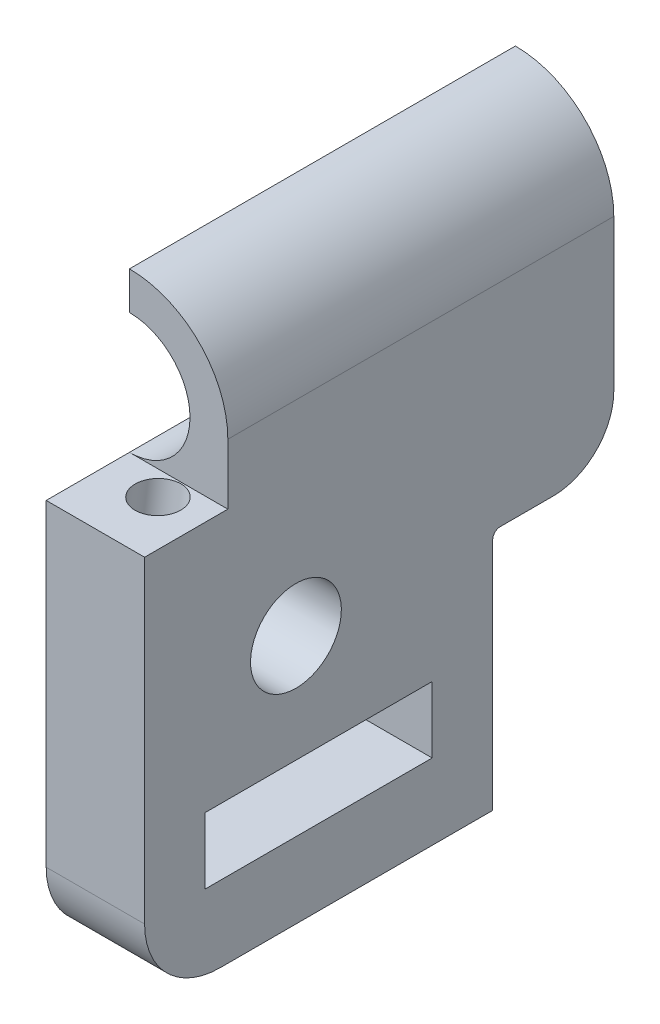
ISO-10303-21;
HEADER;
FILE_DESCRIPTION(('STEP AP214'),'2;1');
FILE_NAME('part.step','',(''),(''),'','','');
FILE_SCHEMA(('AUTOMOTIVE_DESIGN { 1 0 10303 214 1 1 1 1 }'));
ENDSEC;
DATA;
#1=APPLICATION_CONTEXT('core data for automotive mechanical design processes');
#2=APPLICATION_PROTOCOL_DEFINITION('international standard','automotive_design',2000,#1);
#3=PRODUCT_CONTEXT('',#1,'mechanical');
#4=PRODUCT('Part','Part','',(#3));
#5=PRODUCT_RELATED_PRODUCT_CATEGORY('part','',(#4));
#6=PRODUCT_DEFINITION_FORMATION('','',#4);
#7=PRODUCT_DEFINITION_CONTEXT('part definition',#1,'design');
#8=PRODUCT_DEFINITION('design','',#6,#7);
#9=PRODUCT_DEFINITION_SHAPE('','',#8);
#10=(LENGTH_UNIT() NAMED_UNIT(*) SI_UNIT(.MILLI.,.METRE.));
#11=(NAMED_UNIT(*) PLANE_ANGLE_UNIT() SI_UNIT($,.RADIAN.));
#12=(NAMED_UNIT(*) SI_UNIT($,.STERADIAN.) SOLID_ANGLE_UNIT());
#13=UNCERTAINTY_MEASURE_WITH_UNIT(LENGTH_MEASURE(1.E-05),#10,'distance_accuracy_value','');
#14=(GEOMETRIC_REPRESENTATION_CONTEXT(3) GLOBAL_UNCERTAINTY_ASSIGNED_CONTEXT((#13)) GLOBAL_UNIT_ASSIGNED_CONTEXT((#10,
#11,#12)) REPRESENTATION_CONTEXT('',''));
#15=CARTESIAN_POINT('',(0.,0.,0.));
#16=DIRECTION('',(0.,0.,1.));
#17=DIRECTION('',(1.,0.,0.));
#18=AXIS2_PLACEMENT_3D('',#15,#16,#17);
#19=CARTESIAN_POINT('',(-3.75,22.5,31.));
#20=DIRECTION('',(1.,0.,0.));
#21=DIRECTION('',(0.,1.,0.));
#22=AXIS2_PLACEMENT_3D('',#19,#20,#21);
#23=PLANE('',#22);
#24=DIRECTION('',(0.,-1.,0.));
#25=VECTOR('',#24,1.);
#26=CARTESIAN_POINT('',(-3.75,22.5,0.));
#27=LINE('',#26,#25);
#28=CARTESIAN_POINT('',(-3.75,29.,0.));
#29=VERTEX_POINT('',#28);
#30=CARTESIAN_POINT('',(-3.75,26.5,0.));
#31=VERTEX_POINT('',#30);
#32=EDGE_CURVE('E291',#29,#31,#27,.T.);
#33=ORIENTED_EDGE('',*,*,#32,.T.);
#34=DIRECTION('',(0.,0.,1.));
#35=VECTOR('',#34,1.);
#36=CARTESIAN_POINT('',(-3.75,26.5,-0.001000000000001));
#37=LINE('',#36,#35);
#38=CARTESIAN_POINT('',(-3.75,26.5,25.5));
#39=VERTEX_POINT('',#38);
#40=EDGE_CURVE('E230',#31,#39,#37,.T.);
#41=ORIENTED_EDGE('',*,*,#40,.T.);
#42=DIRECTION('',(0.,-1.,0.));
#43=VECTOR('',#42,1.);
#44=CARTESIAN_POINT('',(-3.75,29.,25.5));
#45=LINE('',#44,#43);
#46=CARTESIAN_POINT('',(-3.75,29.,25.5));
#47=VERTEX_POINT('',#46);
#48=EDGE_CURVE('E256',#47,#39,#45,.T.);
#49=ORIENTED_EDGE('',*,*,#48,.F.);
#50=DIRECTION('',(0.,0.,-1.));
#51=VECTOR('',#50,1.);
#52=CARTESIAN_POINT('',(-3.75,29.,31.));
#53=LINE('',#52,#51);
#54=EDGE_CURVE('E295',#47,#29,#53,.T.);
#55=ORIENTED_EDGE('',*,*,#54,.T.);
#56=EDGE_LOOP('',(#33,#41,#49,#55));
#57=FACE_BOUND('',#56,.T.);
#58=ADVANCED_FACE('F45',(#57),#23,.F.);
#59=CARTESIAN_POINT('',(-3.75,22.5,0.));
#60=DIRECTION('',(0.,0.,1.));
#61=DIRECTION('',(1.,0.,0.));
#62=AXIS2_PLACEMENT_3D('',#59,#60,#61);
#63=PLANE('',#62);
#64=CARTESIAN_POINT('',(-3.75,18.5,0.));
#65=VERTEX_POINT('',#64);
#66=CARTESIAN_POINT('',(-3.75,12.5,0.));
#67=VERTEX_POINT('',#66);
#68=EDGE_CURVE('E302',#65,#67,#27,.T.);
#69=ORIENTED_EDGE('',*,*,#68,.F.);
#70=CARTESIAN_POINT('',(-3.75,22.5,0.));
#71=DIRECTION('',(0.,0.,1.));
#72=DIRECTION('',(1.,0.,0.));
#73=AXIS2_PLACEMENT_3D('',#70,#71,#72);
#74=CIRCLE('',#73,4.);
#75=EDGE_CURVE('E224',#31,#65,#74,.F.);
#76=ORIENTED_EDGE('',*,*,#75,.F.);
#77=ORIENTED_EDGE('',*,*,#32,.F.);
#78=CARTESIAN_POINT('',(-3.75,22.5,0.));
#79=DIRECTION('',(0.,0.,1.));
#80=DIRECTION('',(1.,0.,0.));
#81=AXIS2_PLACEMENT_3D('',#78,#79,#80);
#82=CIRCLE('',#81,6.5);
#83=CARTESIAN_POINT('',(2.75,22.5,0.));
#84=VERTEX_POINT('',#83);
#85=EDGE_CURVE('E298',#84,#29,#82,.T.);
#86=ORIENTED_EDGE('',*,*,#85,.F.);
#87=DIRECTION('',(0.,1.,0.));
#88=VECTOR('',#87,1.);
#89=CARTESIAN_POINT('',(2.75,22.5,0.));
#90=LINE('',#89,#88);
#91=CARTESIAN_POINT('',(2.75,12.5,0.));
#92=VERTEX_POINT('',#91);
#93=EDGE_CURVE('E286',#92,#84,#90,.T.);
#94=ORIENTED_EDGE('',*,*,#93,.F.);
#95=DIRECTION('',(-1.,0.,0.));
#96=VECTOR('',#95,1.);
#97=CARTESIAN_POINT('',(-3.75,12.5,0.));
#98=LINE('',#97,#96);
#99=EDGE_CURVE('E333',#92,#67,#98,.T.);
#100=ORIENTED_EDGE('',*,*,#99,.T.);
#101=EDGE_LOOP('',(#69,#76,#77,#86,#94,#100));
#102=FACE_BOUND('',#101,.T.);
#103=ADVANCED_FACE('F391',(#102),#63,.F.);
#104=CARTESIAN_POINT('',(2.75,22.5,31.));
#105=DIRECTION('',(-1.,0.,0.));
#106=DIRECTION('',(0.,-1.,0.));
#107=AXIS2_PLACEMENT_3D('',#104,#105,#106);
#108=PLANE('',#107);
#109=DIRECTION('',(0.,0.,-1.));
#110=VECTOR('',#109,1.);
#111=CARTESIAN_POINT('',(2.75000000000001,1.88804323942946,12.));
#112=LINE('',#111,#110);
#113=CARTESIAN_POINT('',(2.75000000000001,1.88804323942946,27.));
#114=VERTEX_POINT('',#113);
#115=CARTESIAN_POINT('',(2.75000000000001,1.88804323942946,12.));
#116=VERTEX_POINT('',#115);
#117=EDGE_CURVE('E170',#114,#116,#112,.T.);
#118=ORIENTED_EDGE('',*,*,#117,.T.);
#119=DIRECTION('',(0.,-1.,0.));
#120=VECTOR('',#119,1.);
#121=CARTESIAN_POINT('',(2.75000000000001,1.88804323942946,12.));
#122=LINE('',#121,#120);
#123=CARTESIAN_POINT('',(2.75000000000001,-2.48664609,12.));
#124=VERTEX_POINT('',#123);
#125=EDGE_CURVE('E163',#116,#124,#122,.T.);
#126=ORIENTED_EDGE('',*,*,#125,.T.);
#127=DIRECTION('',(0.,0.,1.));
#128=VECTOR('',#127,1.);
#129=CARTESIAN_POINT('',(2.75000000000001,-2.48664609,12.));
#130=LINE('',#129,#128);
#131=CARTESIAN_POINT('',(2.75,-2.48664609,27.));
#132=VERTEX_POINT('',#131);
#133=EDGE_CURVE('E173',#124,#132,#130,.T.);
#134=ORIENTED_EDGE('',*,*,#133,.T.);
#135=DIRECTION('',(0.,1.,0.));
#136=VECTOR('',#135,1.);
#137=CARTESIAN_POINT('',(2.75000000000001,1.88804323942946,27.));
#138=LINE('',#137,#136);
#139=EDGE_CURVE('E61',#132,#114,#138,.T.);
#140=ORIENTED_EDGE('',*,*,#139,.T.);
#141=EDGE_LOOP('',(#118,#126,#134,#140));
#142=FACE_BOUND('',#141,.T.);
#143=CARTESIAN_POINT('',(2.75,9.,21.));
#144=DIRECTION('',(-1.,0.,0.));
#145=DIRECTION('',(0.,-1.,0.));
#146=AXIS2_PLACEMENT_3D('',#143,#144,#145);
#147=CIRCLE('',#146,3.);
#148=CARTESIAN_POINT('',(2.75,6.,21.));
#149=VERTEX_POINT('',#148);
#150=EDGE_CURVE('E252',#149,#149,#147,.T.);
#151=ORIENTED_EDGE('',*,*,#150,.T.);
#152=EDGE_LOOP('',(#151));
#153=FACE_BOUND('',#152,.T.);
#154=DIRECTION('',(0.,1.,0.));
#155=VECTOR('',#154,1.);
#156=CARTESIAN_POINT('',(2.75,22.5,31.));
#157=LINE('',#156,#155);
#158=CARTESIAN_POINT('',(2.75,-2.48664609,31.));
#159=VERTEX_POINT('',#158);
#160=CARTESIAN_POINT('',(2.75,18.5,31.));
#161=VERTEX_POINT('',#160);
#162=EDGE_CURVE('E287',#159,#161,#157,.T.);
#163=ORIENTED_EDGE('',*,*,#162,.F.);
#164=CARTESIAN_POINT('',(2.75,-2.48664609,26.));
#165=DIRECTION('',(-1.,0.,0.));
#166=DIRECTION('',(0.,-1.,0.));
#167=AXIS2_PLACEMENT_3D('',#164,#165,#166);
#168=CIRCLE('',#167,5.);
#169=CARTESIAN_POINT('',(2.75,-7.48664609,26.));
#170=VERTEX_POINT('',#169);
#171=EDGE_CURVE('E11',#159,#170,#168,.F.);
#172=ORIENTED_EDGE('',*,*,#171,.T.);
#173=DIRECTION('',(0.,0.,-1.));
#174=VECTOR('',#173,1.);
#175=CARTESIAN_POINT('',(2.75,-7.48664609,31.));
#176=LINE('',#175,#174);
#177=CARTESIAN_POINT('',(2.75,-7.48664609,8.));
#178=VERTEX_POINT('',#177);
#179=EDGE_CURVE('E216',#170,#178,#176,.T.);
#180=ORIENTED_EDGE('',*,*,#179,.T.);
#181=DIRECTION('',(0.,-1.,0.));
#182=VECTOR('',#181,1.);
#183=CARTESIAN_POINT('',(2.75,8.5,8.));
#184=LINE('',#183,#182);
#185=CARTESIAN_POINT('',(2.75,8.,8.));
#186=VERTEX_POINT('',#185);
#187=EDGE_CURVE('E234',#186,#178,#184,.T.);
#188=ORIENTED_EDGE('',*,*,#187,.F.);
#189=CARTESIAN_POINT('',(2.75,8.,7.5));
#190=DIRECTION('',(-1.,0.,0.));
#191=DIRECTION('',(0.,-1.,0.));
#192=AXIS2_PLACEMENT_3D('',#189,#190,#191);
#193=CIRCLE('',#192,0.5);
#194=CARTESIAN_POINT('',(2.75,8.5,7.5));
#195=VERTEX_POINT('',#194);
#196=EDGE_CURVE('E323',#186,#195,#193,.T.);
#197=ORIENTED_EDGE('',*,*,#196,.T.);
#198=DIRECTION('',(0.,0.,1.));
#199=VECTOR('',#198,1.);
#200=CARTESIAN_POINT('',(2.75,8.5,0.));
#201=LINE('',#200,#199);
#202=CARTESIAN_POINT('',(2.75,8.5,4.));
#203=VERTEX_POINT('',#202);
#204=EDGE_CURVE('E241',#203,#195,#201,.T.);
#205=ORIENTED_EDGE('',*,*,#204,.F.);
#206=CARTESIAN_POINT('',(2.75,12.5,4.));
#207=DIRECTION('',(-1.,0.,0.));
#208=DIRECTION('',(0.,-1.,0.));
#209=AXIS2_PLACEMENT_3D('',#206,#207,#208);
#210=CIRCLE('',#209,4.);
#211=EDGE_CURVE('E330',#203,#92,#210,.F.);
#212=ORIENTED_EDGE('',*,*,#211,.T.);
#213=ORIENTED_EDGE('',*,*,#93,.T.);
#214=DIRECTION('',(0.,0.,-1.));
#215=VECTOR('',#214,1.);
#216=CARTESIAN_POINT('',(2.75,22.5,31.));
#217=LINE('',#216,#215);
#218=CARTESIAN_POINT('',(2.75,22.5,25.5));
#219=VERTEX_POINT('',#218);
#220=EDGE_CURVE('E308',#219,#84,#217,.T.);
#221=ORIENTED_EDGE('',*,*,#220,.F.);
#222=DIRECTION('',(0.,-1.,0.));
#223=VECTOR('',#222,1.);
#224=CARTESIAN_POINT('',(2.75,29.,25.5));
#225=LINE('',#224,#223);
#226=CARTESIAN_POINT('',(2.75,18.5,25.5));
#227=VERTEX_POINT('',#226);
#228=EDGE_CURVE('E260',#219,#227,#225,.T.);
#229=ORIENTED_EDGE('',*,*,#228,.T.);
#230=DIRECTION('',(0.,0.,1.));
#231=VECTOR('',#230,1.);
#232=CARTESIAN_POINT('',(2.75,18.5,31.));
#233=LINE('',#232,#231);
#234=EDGE_CURVE('E264',#227,#161,#233,.T.);
#235=ORIENTED_EDGE('',*,*,#234,.T.);
#236=EDGE_LOOP('',(#163,#172,#180,#188,#197,#205,#212,#213,#221,#229,#235));
#237=FACE_BOUND('',#236,.T.);
#238=ADVANCED_FACE('F178',(#142,#153,#237),#108,.F.);
#239=CARTESIAN_POINT('',(-3.75,22.5,31.));
#240=DIRECTION('',(0.,0.,-1.));
#241=DIRECTION('',(-1.,0.,0.));
#242=AXIS2_PLACEMENT_3D('',#239,#240,#241);
#243=CYLINDRICAL_SURFACE('',#242,6.5);
#244=ORIENTED_EDGE('',*,*,#54,.F.);
#245=CARTESIAN_POINT('',(-3.75,22.5,25.5));
#246=DIRECTION('',(0.,0.,-1.));
#247=DIRECTION('',(-1.,0.,0.));
#248=AXIS2_PLACEMENT_3D('',#245,#246,#247);
#249=CIRCLE('',#248,6.5);
#250=EDGE_CURVE('E279',#47,#219,#249,.T.);
#251=ORIENTED_EDGE('',*,*,#250,.T.);
#252=ORIENTED_EDGE('',*,*,#220,.T.);
#253=ORIENTED_EDGE('',*,*,#85,.T.);
#254=EDGE_LOOP('',(#244,#251,#252,#253));
#255=FACE_BOUND('',#254,.T.);
#256=ADVANCED_FACE('F398',(#255),#243,.T.);
#257=DIRECTION('',(0.,0.,1.));
#258=VECTOR('',#257,1.);
#259=CARTESIAN_POINT('',(-3.75,-2.48664609,12.));
#260=LINE('',#259,#258);
#261=CARTESIAN_POINT('',(-3.75,-2.48664609,12.));
#262=VERTEX_POINT('',#261);
#263=CARTESIAN_POINT('',(-3.75,-2.48664609,27.));
#264=VERTEX_POINT('',#263);
#265=EDGE_CURVE('E195',#262,#264,#260,.T.);
#266=ORIENTED_EDGE('',*,*,#265,.F.);
#267=DIRECTION('',(0.,-1.,0.));
#268=VECTOR('',#267,1.);
#269=CARTESIAN_POINT('',(-3.75,1.88804323942946,12.));
#270=LINE('',#269,#268);
#271=CARTESIAN_POINT('',(-3.75,1.88804323942946,12.));
#272=VERTEX_POINT('',#271);
#273=EDGE_CURVE('E69',#272,#262,#270,.T.);
#274=ORIENTED_EDGE('',*,*,#273,.F.);
#275=DIRECTION('',(0.,0.,-1.));
#276=VECTOR('',#275,1.);
#277=CARTESIAN_POINT('',(-3.75,1.88804323942946,12.));
#278=LINE('',#277,#276);
#279=CARTESIAN_POINT('',(-3.75,1.88804323942946,27.));
#280=VERTEX_POINT('',#279);
#281=EDGE_CURVE('E182',#280,#272,#278,.T.);
#282=ORIENTED_EDGE('',*,*,#281,.F.);
#283=DIRECTION('',(0.,1.,0.));
#284=VECTOR('',#283,1.);
#285=CARTESIAN_POINT('',(-3.75,1.88804323942946,27.));
#286=LINE('',#285,#284);
#287=EDGE_CURVE('E186',#264,#280,#286,.T.);
#288=ORIENTED_EDGE('',*,*,#287,.F.);
#289=EDGE_LOOP('',(#266,#274,#282,#288));
#290=FACE_BOUND('',#289,.T.);
#291=CARTESIAN_POINT('',(-3.75,9.,21.));
#292=DIRECTION('',(-1.,0.,0.));
#293=DIRECTION('',(0.,-1.,0.));
#294=AXIS2_PLACEMENT_3D('',#291,#292,#293);
#295=CIRCLE('',#294,3.);
#296=CARTESIAN_POINT('',(-3.75,6.,21.));
#297=VERTEX_POINT('',#296);
#298=EDGE_CURVE('E251',#297,#297,#295,.T.);
#299=ORIENTED_EDGE('',*,*,#298,.F.);
#300=EDGE_LOOP('',(#299));
#301=FACE_BOUND('',#300,.T.);
#302=DIRECTION('',(0.,0.,-1.));
#303=VECTOR('',#302,1.);
#304=CARTESIAN_POINT('',(-3.75,-7.48664609,8.));
#305=LINE('',#304,#303);
#306=CARTESIAN_POINT('',(-3.75,-7.48664609,26.));
#307=VERTEX_POINT('',#306);
#308=CARTESIAN_POINT('',(-3.75,-7.48664609,8.));
#309=VERTEX_POINT('',#308);
#310=EDGE_CURVE('E204',#307,#309,#305,.T.);
#311=ORIENTED_EDGE('',*,*,#310,.F.);
#312=CARTESIAN_POINT('',(-3.75,-2.48664609,26.));
#313=DIRECTION('',(1.,0.,0.));
#314=DIRECTION('',(0.,1.,0.));
#315=AXIS2_PLACEMENT_3D('',#312,#313,#314);
#316=CIRCLE('',#315,5.);
#317=CARTESIAN_POINT('',(-3.75,-2.48664609,31.));
#318=VERTEX_POINT('',#317);
#319=EDGE_CURVE('E347',#307,#318,#316,.F.);
#320=ORIENTED_EDGE('',*,*,#319,.T.);
#321=DIRECTION('',(0.,-1.,0.));
#322=VECTOR('',#321,1.);
#323=CARTESIAN_POINT('',(-3.75,29.,31.));
#324=LINE('',#323,#322);
#325=CARTESIAN_POINT('',(-3.75,18.5,31.));
#326=VERTEX_POINT('',#325);
#327=EDGE_CURVE('E290',#326,#318,#324,.T.);
#328=ORIENTED_EDGE('',*,*,#327,.F.);
#329=DIRECTION('',(0.,0.,1.));
#330=VECTOR('',#329,1.);
#331=CARTESIAN_POINT('',(-3.75,18.5,31.));
#332=LINE('',#331,#330);
#333=CARTESIAN_POINT('',(-3.75,18.5,25.5));
#334=VERTEX_POINT('',#333);
#335=EDGE_CURVE('E265',#334,#326,#332,.T.);
#336=ORIENTED_EDGE('',*,*,#335,.F.);
#337=DIRECTION('',(0.,0.,1.));
#338=VECTOR('',#337,1.);
#339=CARTESIAN_POINT('',(-3.75,18.5,-0.001000000000001));
#340=LINE('',#339,#338);
#341=EDGE_CURVE('E231',#65,#334,#340,.T.);
#342=ORIENTED_EDGE('',*,*,#341,.F.);
#343=ORIENTED_EDGE('',*,*,#68,.T.);
#344=CARTESIAN_POINT('',(-3.75,12.5,4.));
#345=DIRECTION('',(1.,0.,0.));
#346=DIRECTION('',(0.,1.,0.));
#347=AXIS2_PLACEMENT_3D('',#344,#345,#346);
#348=CIRCLE('',#347,4.);
#349=CARTESIAN_POINT('',(-3.75,8.5,4.));
#350=VERTEX_POINT('',#349);
#351=EDGE_CURVE('E327',#67,#350,#348,.F.);
#352=ORIENTED_EDGE('',*,*,#351,.T.);
#353=DIRECTION('',(0.,0.,-1.));
#354=VECTOR('',#353,1.);
#355=CARTESIAN_POINT('',(-3.75,8.5,0.));
#356=LINE('',#355,#354);
#357=CARTESIAN_POINT('',(-3.75,8.5,7.5));
#358=VERTEX_POINT('',#357);
#359=EDGE_CURVE('E247',#358,#350,#356,.T.);
#360=ORIENTED_EDGE('',*,*,#359,.F.);
#361=CARTESIAN_POINT('',(-3.75,8.,7.5));
#362=DIRECTION('',(1.,0.,0.));
#363=DIRECTION('',(0.,1.,0.));
#364=AXIS2_PLACEMENT_3D('',#361,#362,#363);
#365=CIRCLE('',#364,0.5);
#366=CARTESIAN_POINT('',(-3.75,8.,8.));
#367=VERTEX_POINT('',#366);
#368=EDGE_CURVE('E319',#358,#367,#365,.T.);
#369=ORIENTED_EDGE('',*,*,#368,.T.);
#370=DIRECTION('',(0.,1.,0.));
#371=VECTOR('',#370,1.);
#372=CARTESIAN_POINT('',(-3.75,8.5,8.));
#373=LINE('',#372,#371);
#374=EDGE_CURVE('E244',#309,#367,#373,.T.);
#375=ORIENTED_EDGE('',*,*,#374,.F.);
#376=EDGE_LOOP('',(#311,#320,#328,#336,#342,#343,#352,#360,#369,#375));
#377=FACE_BOUND('',#376,.T.);
#378=ADVANCED_FACE('F368',(#290,#301,#377),#23,.F.);
#379=CARTESIAN_POINT('',(-3.75,22.5,31.));
#380=DIRECTION('',(0.,0.,1.));
#381=DIRECTION('',(1.,0.,0.));
#382=AXIS2_PLACEMENT_3D('',#379,#380,#381);
#383=PLANE('',#382);
#384=ORIENTED_EDGE('',*,*,#327,.T.);
#385=DIRECTION('',(-1.,0.,0.));
#386=VECTOR('',#385,1.);
#387=CARTESIAN_POINT('',(2.75,-2.48664609,31.));
#388=LINE('',#387,#386);
#389=EDGE_CURVE('E54',#318,#159,#388,.F.);
#390=ORIENTED_EDGE('',*,*,#389,.T.);
#391=ORIENTED_EDGE('',*,*,#162,.T.);
#392=DIRECTION('',(-1.,0.,0.));
#393=VECTOR('',#392,1.);
#394=CARTESIAN_POINT('',(2.75,18.5,31.));
#395=LINE('',#394,#393);
#396=EDGE_CURVE('E275',#161,#326,#395,.T.);
#397=ORIENTED_EDGE('',*,*,#396,.T.);
#398=EDGE_LOOP('',(#384,#390,#391,#397));
#399=FACE_BOUND('',#398,.T.);
#400=ADVANCED_FACE('F353',(#399),#383,.T.);
#401=CARTESIAN_POINT('',(2.75,29.,25.5));
#402=DIRECTION('',(0.,0.,-1.));
#403=DIRECTION('',(-1.,0.,0.));
#404=AXIS2_PLACEMENT_3D('',#401,#402,#403);
#405=PLANE('',#404);
#406=ORIENTED_EDGE('',*,*,#48,.T.);
#407=CARTESIAN_POINT('',(-3.75,22.5,25.5));
#408=DIRECTION('',(0.,0.,1.));
#409=DIRECTION('',(1.,0.,0.));
#410=AXIS2_PLACEMENT_3D('',#407,#408,#409);
#411=CIRCLE('',#410,4.);
#412=EDGE_CURVE('E227',#334,#39,#411,.T.);
#413=ORIENTED_EDGE('',*,*,#412,.F.);
#414=DIRECTION('',(-1.,0.,0.));
#415=VECTOR('',#414,1.);
#416=CARTESIAN_POINT('',(2.75,18.5,25.5));
#417=LINE('',#416,#415);
#418=EDGE_CURVE('E269',#227,#334,#417,.T.);
#419=ORIENTED_EDGE('',*,*,#418,.F.);
#420=ORIENTED_EDGE('',*,*,#228,.F.);
#421=ORIENTED_EDGE('',*,*,#250,.F.);
#422=EDGE_LOOP('',(#406,#413,#419,#420,#421));
#423=FACE_BOUND('',#422,.T.);
#424=ADVANCED_FACE('F401',(#423),#405,.F.);
#425=CARTESIAN_POINT('',(2.75,18.5,31.));
#426=DIRECTION('',(0.,-1.,0.));
#427=DIRECTION('',(1.,0.,0.));
#428=AXIS2_PLACEMENT_3D('',#425,#426,#427);
#429=PLANE('',#428);
#430=CARTESIAN_POINT('',(-0.249999999999998,18.5,27.1157241160298));
#431=DIRECTION('',(0.,-1.,0.));
#432=DIRECTION('',(0.,0.,-1.));
#433=AXIS2_PLACEMENT_3D('',#430,#431,#432);
#434=ELLIPSE('',#433,1.51474135877793,1.5);
#435=CARTESIAN_POINT('',(-0.249999999999996,18.5,25.6009827572519));
#436=VERTEX_POINT('',#435);
#437=EDGE_CURVE('E223',#436,#436,#434,.T.);
#438=ORIENTED_EDGE('',*,*,#437,.T.);
#439=EDGE_LOOP('',(#438));
#440=FACE_BOUND('',#439,.T.);
#441=ORIENTED_EDGE('',*,*,#335,.T.);
#442=ORIENTED_EDGE('',*,*,#396,.F.);
#443=ORIENTED_EDGE('',*,*,#234,.F.);
#444=ORIENTED_EDGE('',*,*,#418,.T.);
#445=EDGE_LOOP('',(#441,#442,#443,#444));
#446=FACE_BOUND('',#445,.T.);
#447=ADVANCED_FACE('F408',(#440,#446),#429,.F.);
#448=CARTESIAN_POINT('',(2.75,9.,21.));
#449=DIRECTION('',(-1.,0.,0.));
#450=DIRECTION('',(0.,-1.,0.));
#451=AXIS2_PLACEMENT_3D('',#448,#449,#450);
#452=CYLINDRICAL_SURFACE('',#451,3.);
#453=ORIENTED_EDGE('',*,*,#150,.F.);
#454=EDGE_LOOP('',(#453));
#455=FACE_BOUND('',#454,.T.);
#456=ORIENTED_EDGE('',*,*,#298,.T.);
#457=EDGE_LOOP('',(#456));
#458=FACE_BOUND('',#457,.T.);
#459=ADVANCED_FACE('F410',(#455,#458),#452,.F.);
#460=CARTESIAN_POINT('',(2.75100000000001,8.5,0.));
#461=DIRECTION('',(0.,1.,0.));
#462=DIRECTION('',(-1.,0.,0.));
#463=AXIS2_PLACEMENT_3D('',#460,#461,#462);
#464=PLANE('',#463);
#465=ORIENTED_EDGE('',*,*,#359,.T.);
#466=DIRECTION('',(-1.,0.,0.));
#467=VECTOR('',#466,1.);
#468=CARTESIAN_POINT('',(2.75100000000001,8.5,4.));
#469=LINE('',#468,#467);
#470=EDGE_CURVE('E337',#350,#203,#469,.F.);
#471=ORIENTED_EDGE('',*,*,#470,.T.);
#472=ORIENTED_EDGE('',*,*,#204,.T.);
#473=DIRECTION('',(-1.,0.,0.));
#474=VECTOR('',#473,1.);
#475=CARTESIAN_POINT('',(-3.75,8.5,7.5));
#476=LINE('',#475,#474);
#477=EDGE_CURVE('E315',#195,#358,#476,.T.);
#478=ORIENTED_EDGE('',*,*,#477,.T.);
#479=EDGE_LOOP('',(#465,#471,#472,#478));
#480=FACE_BOUND('',#479,.T.);
#481=ADVANCED_FACE('F380',(#480),#464,.F.);
#482=CARTESIAN_POINT('',(2.75100000000001,8.5,8.));
#483=DIRECTION('',(0.,0.,1.));
#484=DIRECTION('',(0.,-1.,0.));
#485=AXIS2_PLACEMENT_3D('',#482,#483,#484);
#486=PLANE('',#485);
#487=ORIENTED_EDGE('',*,*,#187,.T.);
#488=DIRECTION('',(-1.,0.,0.));
#489=VECTOR('',#488,1.);
#490=CARTESIAN_POINT('',(6.25,-7.48664609,8.));
#491=LINE('',#490,#489);
#492=EDGE_CURVE('E212',#178,#309,#491,.T.);
#493=ORIENTED_EDGE('',*,*,#492,.T.);
#494=ORIENTED_EDGE('',*,*,#374,.T.);
#495=DIRECTION('',(-1.,0.,0.));
#496=VECTOR('',#495,1.);
#497=CARTESIAN_POINT('',(2.75,8.,8.));
#498=LINE('',#497,#496);
#499=EDGE_CURVE('E312',#367,#186,#498,.F.);
#500=ORIENTED_EDGE('',*,*,#499,.T.);
#501=EDGE_LOOP('',(#487,#493,#494,#500));
#502=FACE_BOUND('',#501,.T.);
#503=ADVANCED_FACE('F372',(#502),#486,.F.);
#504=CARTESIAN_POINT('',(2.75100000000001,8.,7.5));
#505=DIRECTION('',(1.,0.,0.));
#506=DIRECTION('',(0.,1.,0.));
#507=AXIS2_PLACEMENT_3D('',#504,#505,#506);
#508=CYLINDRICAL_SURFACE('',#507,0.5);
#509=ORIENTED_EDGE('',*,*,#196,.F.);
#510=ORIENTED_EDGE('',*,*,#499,.F.);
#511=ORIENTED_EDGE('',*,*,#368,.F.);
#512=ORIENTED_EDGE('',*,*,#477,.F.);
#513=EDGE_LOOP('',(#509,#510,#511,#512));
#514=FACE_BOUND('',#513,.T.);
#515=ADVANCED_FACE('F378',(#514),#508,.F.);
#516=CARTESIAN_POINT('',(-3.75,12.5,4.));
#517=DIRECTION('',(-1.,0.,0.));
#518=DIRECTION('',(0.,-1.,0.));
#519=AXIS2_PLACEMENT_3D('',#516,#517,#518);
#520=CYLINDRICAL_SURFACE('',#519,4.);
#521=ORIENTED_EDGE('',*,*,#211,.F.);
#522=ORIENTED_EDGE('',*,*,#470,.F.);
#523=ORIENTED_EDGE('',*,*,#351,.F.);
#524=ORIENTED_EDGE('',*,*,#99,.F.);
#525=EDGE_LOOP('',(#521,#522,#523,#524));
#526=FACE_BOUND('',#525,.T.);
#527=ADVANCED_FACE('F388',(#526),#520,.T.);
#528=CARTESIAN_POINT('',(-3.75,22.5,-0.001000000000001));
#529=DIRECTION('',(0.,0.,1.));
#530=DIRECTION('',(1.,0.,0.));
#531=AXIS2_PLACEMENT_3D('',#528,#529,#530);
#532=CYLINDRICAL_SURFACE('',#531,4.);
#533=ORIENTED_EDGE('',*,*,#75,.T.);
#534=ORIENTED_EDGE('',*,*,#341,.T.);
#535=ORIENTED_EDGE('',*,*,#412,.T.);
#536=ORIENTED_EDGE('',*,*,#40,.F.);
#537=EDGE_LOOP('',(#533,#534,#535,#536));
#538=FACE_BOUND('',#537,.T.);
#539=ADVANCED_FACE('F405',(#538),#532,.F.);
#540=CARTESIAN_POINT('',(-0.249999999999998,1.88811979292941,29.4503716263076));
#541=DIRECTION('',(0.,0.99026806874157,-0.139173100960066));
#542=DIRECTION('',(0.,0.139173100960066,0.99026806874157));
#543=AXIS2_PLACEMENT_3D('',#540,#541,#542);
#544=CYLINDRICAL_SURFACE('',#543,1.5);
#545=CARTESIAN_POINT('',(-0.249999999999998,1.88811979292941,29.4503716263076));
#546=DIRECTION('',(0.,0.99026806874157,-0.139173100960066));
#547=DIRECTION('',(0.,0.139173100960066,0.99026806874157));
#548=AXIS2_PLACEMENT_3D('',#545,#546,#547);
#549=CIRCLE('',#548,1.5);
#550=CARTESIAN_POINT('',(-0.249999999999998,2.09687944436951,30.93577372942));
#551=VERTEX_POINT('',#550);
#552=EDGE_CURVE('E219',#551,#551,#549,.T.);
#553=ORIENTED_EDGE('',*,*,#552,.F.);
#554=EDGE_LOOP('',(#553));
#555=FACE_BOUND('',#554,.T.);
#556=ORIENTED_EDGE('',*,*,#437,.F.);
#557=EDGE_LOOP('',(#556));
#558=FACE_BOUND('',#557,.T.);
#559=ADVANCED_FACE('F462',(#555,#558),#544,.F.);
#560=CARTESIAN_POINT('',(-0.249999999999998,1.88811979292941,29.4503716263076));
#561=DIRECTION('',(0.,0.99026806874157,-0.139173100960066));
#562=DIRECTION('',(0.,0.139173100960066,0.99026806874157));
#563=AXIS2_PLACEMENT_3D('',#560,#561,#562);
#564=PLANE('',#563);
#565=ORIENTED_EDGE('',*,*,#552,.T.);
#566=EDGE_LOOP('',(#565));
#567=FACE_BOUND('',#566,.T.);
#568=ADVANCED_FACE('F459',(#567),#564,.T.);
#569=CARTESIAN_POINT('',(6.25,-7.48664609,8.));
#570=DIRECTION('',(0.,1.,0.));
#571=DIRECTION('',(-1.,0.,0.));
#572=AXIS2_PLACEMENT_3D('',#569,#570,#571);
#573=PLANE('',#572);
#574=ORIENTED_EDGE('',*,*,#179,.F.);
#575=DIRECTION('',(-1.,0.,0.));
#576=VECTOR('',#575,1.);
#577=CARTESIAN_POINT('',(-3.75,-7.48664609,26.));
#578=LINE('',#577,#576);
#579=EDGE_CURVE('E340',#170,#307,#578,.T.);
#580=ORIENTED_EDGE('',*,*,#579,.T.);
#581=ORIENTED_EDGE('',*,*,#310,.T.);
#582=ORIENTED_EDGE('',*,*,#492,.F.);
#583=EDGE_LOOP('',(#574,#580,#581,#582));
#584=FACE_BOUND('',#583,.T.);
#585=ADVANCED_FACE('F364',(#584),#573,.F.);
#586=CARTESIAN_POINT('',(6.25,-2.48664609,26.));
#587=DIRECTION('',(1.,0.,0.));
#588=DIRECTION('',(0.,1.,0.));
#589=AXIS2_PLACEMENT_3D('',#586,#587,#588);
#590=CYLINDRICAL_SURFACE('',#589,5.);
#591=ORIENTED_EDGE('',*,*,#171,.F.);
#592=ORIENTED_EDGE('',*,*,#389,.F.);
#593=ORIENTED_EDGE('',*,*,#319,.F.);
#594=ORIENTED_EDGE('',*,*,#579,.F.);
#595=EDGE_LOOP('',(#591,#592,#593,#594));
#596=FACE_BOUND('',#595,.T.);
#597=ADVANCED_FACE('F47',(#596),#590,.T.);
#598=CARTESIAN_POINT('',(2.75000000000001,1.88804323942946,12.));
#599=DIRECTION('',(0.,0.,-1.));
#600=DIRECTION('',(-1.,0.,0.));
#601=AXIS2_PLACEMENT_3D('',#598,#599,#600);
#602=PLANE('',#601);
#603=ORIENTED_EDGE('',*,*,#273,.T.);
#604=DIRECTION('',(-1.,0.,0.));
#605=VECTOR('',#604,1.);
#606=CARTESIAN_POINT('',(2.75000000000001,-2.48664609,12.));
#607=LINE('',#606,#605);
#608=EDGE_CURVE('E159',#124,#262,#607,.T.);
#609=ORIENTED_EDGE('',*,*,#608,.F.);
#610=ORIENTED_EDGE('',*,*,#125,.F.);
#611=DIRECTION('',(-1.,0.,0.));
#612=VECTOR('',#611,1.);
#613=CARTESIAN_POINT('',(2.75000000000001,1.88804323942946,12.));
#614=LINE('',#613,#612);
#615=EDGE_CURVE('E201',#116,#272,#614,.T.);
#616=ORIENTED_EDGE('',*,*,#615,.T.);
#617=EDGE_LOOP('',(#603,#609,#610,#616));
#618=FACE_BOUND('',#617,.T.);
#619=ADVANCED_FACE('F161',(#618),#602,.F.);
#620=CARTESIAN_POINT('',(2.75000000000001,1.88804323942946,12.));
#621=DIRECTION('',(0.,1.,0.));
#622=DIRECTION('',(-1.,0.,0.));
#623=AXIS2_PLACEMENT_3D('',#620,#621,#622);
#624=PLANE('',#623);
#625=ORIENTED_EDGE('',*,*,#281,.T.);
#626=ORIENTED_EDGE('',*,*,#615,.F.);
#627=ORIENTED_EDGE('',*,*,#117,.F.);
#628=DIRECTION('',(-1.,0.,0.));
#629=VECTOR('',#628,1.);
#630=CARTESIAN_POINT('',(2.75000000000001,1.88804323942946,27.));
#631=LINE('',#630,#629);
#632=EDGE_CURVE('E205',#114,#280,#631,.T.);
#633=ORIENTED_EDGE('',*,*,#632,.T.);
#634=EDGE_LOOP('',(#625,#626,#627,#633));
#635=FACE_BOUND('',#634,.T.);
#636=ADVANCED_FACE('F446',(#635),#624,.F.);
#637=CARTESIAN_POINT('',(2.75000000000001,1.88804323942946,27.));
#638=DIRECTION('',(0.,0.,1.));
#639=DIRECTION('',(1.,0.,0.));
#640=AXIS2_PLACEMENT_3D('',#637,#638,#639);
#641=PLANE('',#640);
#642=ORIENTED_EDGE('',*,*,#287,.T.);
#643=ORIENTED_EDGE('',*,*,#632,.F.);
#644=ORIENTED_EDGE('',*,*,#139,.F.);
#645=DIRECTION('',(-1.,0.,0.));
#646=VECTOR('',#645,1.);
#647=CARTESIAN_POINT('',(2.75000000000001,-2.48664609,27.));
#648=LINE('',#647,#646);
#649=EDGE_CURVE('E169',#132,#264,#648,.T.);
#650=ORIENTED_EDGE('',*,*,#649,.T.);
#651=EDGE_LOOP('',(#642,#643,#644,#650));
#652=FACE_BOUND('',#651,.T.);
#653=ADVANCED_FACE('F444',(#652),#641,.F.);
#654=CARTESIAN_POINT('',(2.75000000000001,-2.48664609,12.));
#655=DIRECTION('',(0.,-1.,0.));
#656=DIRECTION('',(1.,0.,0.));
#657=AXIS2_PLACEMENT_3D('',#654,#655,#656);
#658=PLANE('',#657);
#659=ORIENTED_EDGE('',*,*,#265,.T.);
#660=ORIENTED_EDGE('',*,*,#649,.F.);
#661=ORIENTED_EDGE('',*,*,#133,.F.);
#662=ORIENTED_EDGE('',*,*,#608,.T.);
#663=EDGE_LOOP('',(#659,#660,#661,#662));
#664=FACE_BOUND('',#663,.T.);
#665=ADVANCED_FACE('F174',(#664),#658,.F.);
#666=CLOSED_SHELL('',(#58,#103,#238,#256,#378,#400,#424,#447,#459,#481,#503,#515,#527,#539,#559,
#568,#585,#597,#619,#636,#653,#665));
#667=MANIFOLD_SOLID_BREP('B2',#666);
#668=ADVANCED_BREP_SHAPE_REPRESENTATION('',(#18,#667),#14);
#669=SHAPE_DEFINITION_REPRESENTATION(#9,#668);
ENDSEC;
END-ISO-10303-21;
